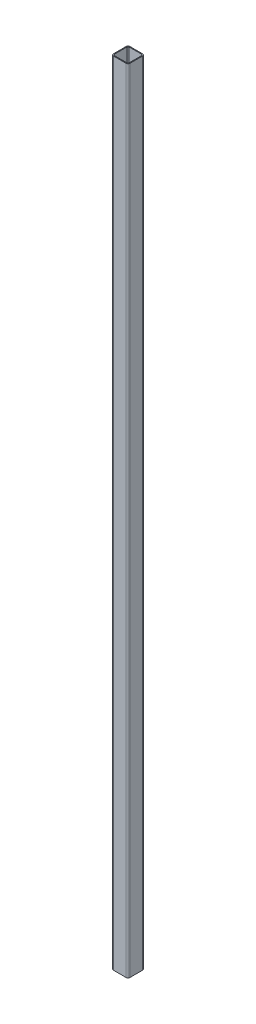
ISO-10303-21;
HEADER;
FILE_DESCRIPTION(('STEP AP214'),'2;1');
FILE_NAME('part.step','',(''),(''),'','','');
FILE_SCHEMA(('AUTOMOTIVE_DESIGN { 1 0 10303 214 1 1 1 1 }'));
ENDSEC;
DATA;
#1=APPLICATION_CONTEXT('core data for automotive mechanical design processes');
#2=APPLICATION_PROTOCOL_DEFINITION('international standard','automotive_design',2000,#1);
#3=PRODUCT_CONTEXT('',#1,'mechanical');
#4=PRODUCT('Part','Part','',(#3));
#5=PRODUCT_RELATED_PRODUCT_CATEGORY('part','',(#4));
#6=PRODUCT_DEFINITION_FORMATION('','',#4);
#7=PRODUCT_DEFINITION_CONTEXT('part definition',#1,'design');
#8=PRODUCT_DEFINITION('design','',#6,#7);
#9=PRODUCT_DEFINITION_SHAPE('','',#8);
#10=(LENGTH_UNIT() NAMED_UNIT(*) SI_UNIT(.MILLI.,.METRE.));
#11=(NAMED_UNIT(*) PLANE_ANGLE_UNIT() SI_UNIT($,.RADIAN.));
#12=(NAMED_UNIT(*) SI_UNIT($,.STERADIAN.) SOLID_ANGLE_UNIT());
#13=UNCERTAINTY_MEASURE_WITH_UNIT(LENGTH_MEASURE(1.E-05),#10,'distance_accuracy_value','');
#14=(GEOMETRIC_REPRESENTATION_CONTEXT(3) GLOBAL_UNCERTAINTY_ASSIGNED_CONTEXT((#13)) GLOBAL_UNIT_ASSIGNED_CONTEXT((#10,
#11,#12)) REPRESENTATION_CONTEXT('',''));
#15=CARTESIAN_POINT('',(0.,0.,0.));
#16=DIRECTION('',(0.,0.,1.));
#17=DIRECTION('',(1.,0.,0.));
#18=AXIS2_PLACEMENT_3D('',#15,#16,#17);
#19=CARTESIAN_POINT('',(-14.9999999999979,6.55031584528842E-12,-885.000000000003));
#20=DIRECTION('',(0.,1.00000000000002,0.));
#21=DIRECTION('',(0.,0.,1.));
#22=AXIS2_PLACEMENT_3D('',#19,#20,#21);
#23=CYLINDRICAL_SURFACE('',#22,3.);
#24=DIRECTION('',(0.,1.00000000000002,0.));
#25=VECTOR('',#24,1.);
#26=CARTESIAN_POINT('',(-15.0000000000001,6.55031584528842E-12,-882.000000000003));
#27=LINE('',#26,#25);
#28=CARTESIAN_POINT('',(-15.0000000000006,20.0000000000066,-882.000000000003));
#29=VERTEX_POINT('',#28);
#30=CARTESIAN_POINT('',(-14.9999999999928,1940.00000000004,-882.000000000015));
#31=VERTEX_POINT('',#30);
#32=EDGE_CURVE('E252',#29,#31,#27,.T.);
#33=ORIENTED_EDGE('',*,*,#32,.F.);
#34=CARTESIAN_POINT('',(-14.9999999999983,20.0000000000066,-885.000000000003));
#35=DIRECTION('',(0.,-1.00000000000002,0.));
#36=DIRECTION('',(0.,0.,-1.));
#37=AXIS2_PLACEMENT_3D('',#34,#35,#36);
#38=CIRCLE('',#37,3.);
#39=CARTESIAN_POINT('',(-17.9999999999982,20.0000000000067,-885.000000000003));
#40=VERTEX_POINT('',#39);
#41=EDGE_CURVE('E276',#29,#40,#38,.T.);
#42=ORIENTED_EDGE('',*,*,#41,.T.);
#43=DIRECTION('',(0.,1.00000000000002,0.));
#44=VECTOR('',#43,1.);
#45=CARTESIAN_POINT('',(-17.999999999998,6.66133814775094E-12,-885.000000000003));
#46=LINE('',#45,#44);
#47=CARTESIAN_POINT('',(-17.9999999999905,1940.00000000004,-885.000000000012));
#48=VERTEX_POINT('',#47);
#49=EDGE_CURVE('E50',#40,#48,#46,.T.);
#50=ORIENTED_EDGE('',*,*,#49,.T.);
#51=CARTESIAN_POINT('',(-14.9999999999908,1940.00000000004,-885.000000000015));
#52=DIRECTION('',(0.,1.00000000000002,0.));
#53=DIRECTION('',(0.,0.,1.));
#54=AXIS2_PLACEMENT_3D('',#51,#52,#53);
#55=CIRCLE('',#54,3.);
#56=EDGE_CURVE('E266',#48,#31,#55,.T.);
#57=ORIENTED_EDGE('',*,*,#56,.T.);
#58=EDGE_LOOP('',(#33,#42,#50,#57));
#59=FACE_BOUND('',#58,.T.);
#60=ADVANCED_FACE('F47',(#59),#23,.F.);
#61=CARTESIAN_POINT('',(-15.0000000000001,6.55031584528842E-12,-882.000000000003));
#62=DIRECTION('',(0.,0.,-1.));
#63=DIRECTION('',(0.,1.00000000000002,0.));
#64=AXIS2_PLACEMENT_3D('',#61,#62,#63);
#65=PLANE('',#64);
#66=DIRECTION('',(0.,1.00000000000002,0.));
#67=VECTOR('',#66,1.);
#68=CARTESIAN_POINT('',(14.9999999999997,3.44169137633799E-12,-882.000000000003));
#69=LINE('',#68,#67);
#70=CARTESIAN_POINT('',(14.9999999999995,20.0000000000066,-882.000000000003));
#71=VERTEX_POINT('',#70);
#72=CARTESIAN_POINT('',(15.000000000007,1940.00000000004,-882.000000000011));
#73=VERTEX_POINT('',#72);
#74=EDGE_CURVE('E248',#71,#73,#69,.T.);
#75=ORIENTED_EDGE('',*,*,#74,.F.);
#76=DIRECTION('',(-0.999999999999991,0.,0.));
#77=VECTOR('',#76,1.);
#78=CARTESIAN_POINT('',(-15.0000000000006,20.0000000000066,-882.000000000003));
#79=LINE('',#78,#77);
#80=EDGE_CURVE('E255',#71,#29,#79,.T.);
#81=ORIENTED_EDGE('',*,*,#80,.T.);
#82=ORIENTED_EDGE('',*,*,#32,.T.);
#83=DIRECTION('',(0.999999999999991,0.,0.));
#84=VECTOR('',#83,1.);
#85=CARTESIAN_POINT('',(-14.9999999999928,1940.00000000004,-882.000000000015));
#86=LINE('',#85,#84);
#87=EDGE_CURVE('E254',#31,#73,#86,.T.);
#88=ORIENTED_EDGE('',*,*,#87,.T.);
#89=EDGE_LOOP('',(#75,#81,#82,#88));
#90=FACE_BOUND('',#89,.T.);
#91=ADVANCED_FACE('F387',(#90),#65,.T.);
#92=CARTESIAN_POINT('',(15.0000000000019,3.44169137633799E-12,-885.000000000003));
#93=DIRECTION('',(0.,1.00000000000002,0.));
#94=DIRECTION('',(0.,0.,1.));
#95=AXIS2_PLACEMENT_3D('',#92,#93,#94);
#96=CYLINDRICAL_SURFACE('',#95,3.);
#97=DIRECTION('',(0.,1.00000000000002,0.));
#98=VECTOR('',#97,1.);
#99=CARTESIAN_POINT('',(18.0000000000018,3.33066907387547E-12,-885.000000000003));
#100=LINE('',#99,#98);
#101=CARTESIAN_POINT('',(17.9999999999993,20.0000000000035,-885.000000000001));
#102=VERTEX_POINT('',#101);
#103=CARTESIAN_POINT('',(18.0000000000093,1940.00000000004,-885.00000000001));
#104=VERTEX_POINT('',#103);
#105=EDGE_CURVE('E243',#102,#104,#100,.T.);
#106=ORIENTED_EDGE('',*,*,#105,.F.);
#107=CARTESIAN_POINT('',(14.9999999999997,20.0000000000066,-885.000000000003));
#108=DIRECTION('',(0.,-1.00000000000002,0.));
#109=DIRECTION('',(0.,0.,-1.));
#110=AXIS2_PLACEMENT_3D('',#107,#108,#109);
#111=CIRCLE('',#110,3.);
#112=EDGE_CURVE('E251',#102,#71,#111,.T.);
#113=ORIENTED_EDGE('',*,*,#112,.T.);
#114=ORIENTED_EDGE('',*,*,#74,.T.);
#115=CARTESIAN_POINT('',(15.0000000000092,1940.00000000004,-885.000000000012));
#116=DIRECTION('',(0.,1.00000000000002,0.));
#117=DIRECTION('',(0.,0.,1.));
#118=AXIS2_PLACEMENT_3D('',#115,#116,#117);
#119=CIRCLE('',#118,3.);
#120=EDGE_CURVE('E250',#73,#104,#119,.T.);
#121=ORIENTED_EDGE('',*,*,#120,.T.);
#122=EDGE_LOOP('',(#106,#113,#114,#121));
#123=FACE_BOUND('',#122,.T.);
#124=ADVANCED_FACE('F380',(#123),#96,.F.);
#125=CARTESIAN_POINT('',(18.0000000000018,3.33066907387547E-12,-885.000000000003));
#126=DIRECTION('',(-0.999999999999991,0.,0.));
#127=DIRECTION('',(0.,0.,1.));
#128=AXIS2_PLACEMENT_3D('',#125,#126,#127);
#129=PLANE('',#128);
#130=DIRECTION('',(0.,1.00000000000002,0.));
#131=VECTOR('',#130,1.);
#132=CARTESIAN_POINT('',(17.9999999999996,3.44169137633799E-12,-915.000000000003));
#133=LINE('',#132,#131);
#134=CARTESIAN_POINT('',(17.9999999999996,20.0000000000035,-915.000000000003));
#135=VERTEX_POINT('',#134);
#136=CARTESIAN_POINT('',(18.0000000000071,1940.00000000004,-915.000000000011));
#137=VERTEX_POINT('',#136);
#138=EDGE_CURVE('E238',#135,#137,#133,.T.);
#139=ORIENTED_EDGE('',*,*,#138,.F.);
#140=DIRECTION('',(0.,0.,1.));
#141=VECTOR('',#140,1.);
#142=CARTESIAN_POINT('',(17.9999999999993,20.0000000000035,-885.000000000003));
#143=LINE('',#142,#141);
#144=EDGE_CURVE('E247',#135,#102,#143,.T.);
#145=ORIENTED_EDGE('',*,*,#144,.T.);
#146=ORIENTED_EDGE('',*,*,#105,.T.);
#147=DIRECTION('',(0.,0.,-1.));
#148=VECTOR('',#147,1.);
#149=CARTESIAN_POINT('',(18.0000000000093,1940.00000000004,-885.000000000012));
#150=LINE('',#149,#148);
#151=EDGE_CURVE('E246',#104,#137,#150,.T.);
#152=ORIENTED_EDGE('',*,*,#151,.T.);
#153=EDGE_LOOP('',(#139,#145,#146,#152));
#154=FACE_BOUND('',#153,.T.);
#155=ADVANCED_FACE('F393',(#154),#129,.T.);
#156=CARTESIAN_POINT('',(14.9999999999997,3.44169137633799E-12,-915.000000000003));
#157=DIRECTION('',(0.,1.00000000000002,0.));
#158=DIRECTION('',(0.,0.,1.));
#159=AXIS2_PLACEMENT_3D('',#156,#157,#158);
#160=CYLINDRICAL_SURFACE('',#159,3.);
#161=DIRECTION('',(0.,1.00000000000002,0.));
#162=VECTOR('',#161,1.);
#163=CARTESIAN_POINT('',(15.0000000000019,3.44169137633799E-12,-918.000000000003));
#164=LINE('',#163,#162);
#165=CARTESIAN_POINT('',(15.0000000000017,20.0000000000067,-918.000000000003));
#166=VERTEX_POINT('',#165);
#167=CARTESIAN_POINT('',(15.0000000000092,1940.00000000004,-918.000000000011));
#168=VERTEX_POINT('',#167);
#169=EDGE_CURVE('E233',#166,#168,#164,.T.);
#170=ORIENTED_EDGE('',*,*,#169,.F.);
#171=CARTESIAN_POINT('',(14.9999999999995,20.0000000000066,-915.000000000003));
#172=DIRECTION('',(0.,-1.00000000000002,0.));
#173=DIRECTION('',(0.,0.,-1.));
#174=AXIS2_PLACEMENT_3D('',#171,#172,#173);
#175=CIRCLE('',#174,3.);
#176=EDGE_CURVE('E242',#166,#135,#175,.T.);
#177=ORIENTED_EDGE('',*,*,#176,.T.);
#178=ORIENTED_EDGE('',*,*,#138,.T.);
#179=CARTESIAN_POINT('',(15.000000000007,1940.00000000004,-915.000000000011));
#180=DIRECTION('',(0.,1.00000000000002,0.));
#181=DIRECTION('',(0.,0.,1.));
#182=AXIS2_PLACEMENT_3D('',#179,#180,#181);
#183=CIRCLE('',#182,3.);
#184=EDGE_CURVE('E241',#137,#168,#183,.T.);
#185=ORIENTED_EDGE('',*,*,#184,.T.);
#186=EDGE_LOOP('',(#170,#177,#178,#185));
#187=FACE_BOUND('',#186,.T.);
#188=ADVANCED_FACE('F400',(#187),#160,.F.);
#189=CARTESIAN_POINT('',(-14.9999999999979,6.66133814775094E-12,-918.000000000003));
#190=DIRECTION('',(0.,0.,1.));
#191=DIRECTION('',(0.,-1.00000000000002,0.));
#192=AXIS2_PLACEMENT_3D('',#189,#190,#191);
#193=PLANE('',#192);
#194=DIRECTION('',(0.,1.00000000000002,0.));
#195=VECTOR('',#194,1.);
#196=CARTESIAN_POINT('',(-14.9999999999979,6.66133814775094E-12,-918.000000000003));
#197=LINE('',#196,#195);
#198=CARTESIAN_POINT('',(-14.9999999999983,20.0000000000066,-918.000000000003));
#199=VERTEX_POINT('',#198);
#200=CARTESIAN_POINT('',(-14.9999999999908,1940.00000000004,-918.000000000015));
#201=VERTEX_POINT('',#200);
#202=EDGE_CURVE('E229',#199,#201,#197,.T.);
#203=ORIENTED_EDGE('',*,*,#202,.F.);
#204=DIRECTION('',(0.999999999999991,0.,0.));
#205=VECTOR('',#204,1.);
#206=CARTESIAN_POINT('',(-14.9999999999983,20.0000000000066,-918.000000000003));
#207=LINE('',#206,#205);
#208=EDGE_CURVE('E237',#199,#166,#207,.T.);
#209=ORIENTED_EDGE('',*,*,#208,.T.);
#210=ORIENTED_EDGE('',*,*,#169,.T.);
#211=DIRECTION('',(-0.999999999999991,0.,0.));
#212=VECTOR('',#211,1.);
#213=CARTESIAN_POINT('',(-14.9999999999908,1940.00000000004,-918.000000000015));
#214=LINE('',#213,#212);
#215=EDGE_CURVE('E236',#168,#201,#214,.T.);
#216=ORIENTED_EDGE('',*,*,#215,.T.);
#217=EDGE_LOOP('',(#203,#209,#210,#216));
#218=FACE_BOUND('',#217,.T.);
#219=ADVANCED_FACE('F404',(#218),#193,.T.);
#220=CARTESIAN_POINT('',(-15.0000000000001,6.66133814775094E-12,-915.000000000003));
#221=DIRECTION('',(0.,1.00000000000002,0.));
#222=DIRECTION('',(0.,0.,1.));
#223=AXIS2_PLACEMENT_3D('',#220,#221,#222);
#224=CYLINDRICAL_SURFACE('',#223,3.);
#225=DIRECTION('',(0.,1.00000000000002,0.));
#226=VECTOR('',#225,1.);
#227=CARTESIAN_POINT('',(-18.0000000000002,6.66133814775094E-12,-915.000000000003));
#228=LINE('',#227,#226);
#229=CARTESIAN_POINT('',(-18.0000000000005,20.0000000000068,-915.000000000003));
#230=VERTEX_POINT('',#229);
#231=CARTESIAN_POINT('',(-17.9999999999927,1940.00000000004,-915.000000000012));
#232=VERTEX_POINT('',#231);
#233=EDGE_CURVE('E205',#230,#232,#228,.T.);
#234=ORIENTED_EDGE('',*,*,#233,.F.);
#235=CARTESIAN_POINT('',(-15.0000000000006,20.0000000000066,-915.000000000003));
#236=DIRECTION('',(0.,-1.00000000000002,0.));
#237=DIRECTION('',(0.,0.,-1.));
#238=AXIS2_PLACEMENT_3D('',#235,#236,#237);
#239=CIRCLE('',#238,3.);
#240=EDGE_CURVE('E232',#230,#199,#239,.T.);
#241=ORIENTED_EDGE('',*,*,#240,.T.);
#242=ORIENTED_EDGE('',*,*,#202,.T.);
#243=CARTESIAN_POINT('',(-14.9999999999928,1940.00000000004,-915.000000000015));
#244=DIRECTION('',(0.,1.00000000000002,0.));
#245=DIRECTION('',(0.,0.,1.));
#246=AXIS2_PLACEMENT_3D('',#243,#244,#245);
#247=CIRCLE('',#246,3.);
#248=EDGE_CURVE('E228',#201,#232,#247,.T.);
#249=ORIENTED_EDGE('',*,*,#248,.T.);
#250=EDGE_LOOP('',(#234,#241,#242,#249));
#251=FACE_BOUND('',#250,.T.);
#252=ADVANCED_FACE('F408',(#251),#224,.F.);
#253=CARTESIAN_POINT('',(-15.4999999999983,6.55031584528842E-12,-884.500000000004));
#254=DIRECTION('',(0.,1.00000000000002,0.));
#255=DIRECTION('',(0.,0.,1.));
#256=AXIS2_PLACEMENT_3D('',#253,#254,#255);
#257=CYLINDRICAL_SURFACE('',#256,4.5);
#258=CARTESIAN_POINT('',(-15.5000000000047,20.0000000000066,-884.500000000004));
#259=DIRECTION('',(0.,-1.00000000000002,0.));
#260=DIRECTION('',(0.,0.,-1.));
#261=AXIS2_PLACEMENT_3D('',#258,#259,#260);
#262=CIRCLE('',#261,4.5);
#263=CARTESIAN_POINT('',(-15.5000000000045,20.0000000000066,-880.000000000003));
#264=VERTEX_POINT('',#263);
#265=CARTESIAN_POINT('',(-20.0000000000047,20.0000000000067,-884.500000000001));
#266=VERTEX_POINT('',#265);
#267=EDGE_CURVE('E57',#264,#266,#262,.T.);
#268=ORIENTED_EDGE('',*,*,#267,.F.);
#269=DIRECTION('',(0.,1.00000000000002,0.));
#270=VECTOR('',#269,1.);
#271=CARTESIAN_POINT('',(-15.4999999999981,6.55031584528842E-12,-880.000000000003));
#272=LINE('',#271,#270);
#273=CARTESIAN_POINT('',(-15.4999999999907,1940.00000000004,-880.000000000012));
#274=VERTEX_POINT('',#273);
#275=EDGE_CURVE('E189',#264,#274,#272,.T.);
#276=ORIENTED_EDGE('',*,*,#275,.T.);
#277=CARTESIAN_POINT('',(-15.499999999997,1940.00000000004,-884.500000000011));
#278=DIRECTION('',(0.,1.00000000000002,0.));
#279=DIRECTION('',(0.,0.,1.));
#280=AXIS2_PLACEMENT_3D('',#277,#278,#279);
#281=CIRCLE('',#280,4.5);
#282=CARTESIAN_POINT('',(-19.9999999999971,1940.00000000004,-884.50000000001));
#283=VERTEX_POINT('',#282);
#284=EDGE_CURVE('E321',#283,#274,#281,.T.);
#285=ORIENTED_EDGE('',*,*,#284,.F.);
#286=DIRECTION('',(0.,1.00000000000002,0.));
#287=VECTOR('',#286,1.);
#288=CARTESIAN_POINT('',(-19.9999999999982,6.66133814775094E-12,-884.500000000003));
#289=LINE('',#288,#287);
#290=EDGE_CURVE('E223',#266,#283,#289,.T.);
#291=ORIENTED_EDGE('',*,*,#290,.F.);
#292=EDGE_LOOP('',(#268,#276,#285,#291));
#293=FACE_BOUND('',#292,.T.);
#294=ADVANCED_FACE('F350',(#293),#257,.T.);
#295=CARTESIAN_POINT('',(-19.9999999999982,6.66133814775094E-12,-884.500000000003));
#296=DIRECTION('',(0.999999999999991,0.,0.));
#297=DIRECTION('',(0.,0.,-1.));
#298=AXIS2_PLACEMENT_3D('',#295,#296,#297);
#299=PLANE('',#298);
#300=DIRECTION('',(0.,0.,-1.));
#301=VECTOR('',#300,1.);
#302=CARTESIAN_POINT('',(-20.0000000000065,20.0000000000022,-2.22044604925031E-12));
#303=LINE('',#302,#301);
#304=CARTESIAN_POINT('',(-20.0000000000025,20.0000000000068,-915.500000000002));
#305=VERTEX_POINT('',#304);
#306=EDGE_CURVE('E11',#266,#305,#303,.T.);
#307=ORIENTED_EDGE('',*,*,#306,.F.);
#308=ORIENTED_EDGE('',*,*,#290,.T.);
#309=DIRECTION('',(0.,0.,1.));
#310=VECTOR('',#309,1.);
#311=CARTESIAN_POINT('',(-19.9999999999891,1940.00000000005,-3060.));
#312=LINE('',#311,#310);
#313=CARTESIAN_POINT('',(-19.9999999999949,1940.00000000004,-915.500000000012));
#314=VERTEX_POINT('',#313);
#315=EDGE_CURVE('E327',#314,#283,#312,.T.);
#316=ORIENTED_EDGE('',*,*,#315,.F.);
#317=DIRECTION('',(0.,1.00000000000002,0.));
#318=VECTOR('',#317,1.);
#319=CARTESIAN_POINT('',(-19.999999999996,6.66133814775094E-12,-915.500000000002));
#320=LINE('',#319,#318);
#321=EDGE_CURVE('E220',#305,#314,#320,.T.);
#322=ORIENTED_EDGE('',*,*,#321,.F.);
#323=EDGE_LOOP('',(#307,#308,#316,#322));
#324=FACE_BOUND('',#323,.T.);
#325=ADVANCED_FACE('F346',(#324),#299,.F.);
#326=CARTESIAN_POINT('',(-15.4999999999961,6.66133814775094E-12,-915.500000000004));
#327=DIRECTION('',(0.,1.00000000000002,0.));
#328=DIRECTION('',(0.,0.,1.));
#329=AXIS2_PLACEMENT_3D('',#326,#327,#328);
#330=CYLINDRICAL_SURFACE('',#329,4.5);
#331=CARTESIAN_POINT('',(-15.5000000000027,20.0000000000066,-915.500000000004));
#332=DIRECTION('',(0.,-1.00000000000002,0.));
#333=DIRECTION('',(0.,0.,-1.));
#334=AXIS2_PLACEMENT_3D('',#331,#332,#333);
#335=CIRCLE('',#334,4.5);
#336=CARTESIAN_POINT('',(-15.5000000000027,20.0000000000066,-920.000000000004));
#337=VERTEX_POINT('',#336);
#338=EDGE_CURVE('E316',#305,#337,#335,.T.);
#339=ORIENTED_EDGE('',*,*,#338,.F.);
#340=ORIENTED_EDGE('',*,*,#321,.T.);
#341=CARTESIAN_POINT('',(-15.499999999995,1940.00000000004,-915.500000000012));
#342=DIRECTION('',(0.,1.00000000000002,0.));
#343=DIRECTION('',(0.,0.,1.));
#344=AXIS2_PLACEMENT_3D('',#341,#342,#343);
#345=CIRCLE('',#344,4.5);
#346=CARTESIAN_POINT('',(-15.499999999995,1940.00000000004,-920.000000000012));
#347=VERTEX_POINT('',#346);
#348=EDGE_CURVE('E323',#347,#314,#345,.T.);
#349=ORIENTED_EDGE('',*,*,#348,.F.);
#350=DIRECTION('',(0.,1.00000000000002,0.));
#351=VECTOR('',#350,1.);
#352=CARTESIAN_POINT('',(-15.4999999999961,6.66133814775094E-12,-920.000000000004));
#353=LINE('',#352,#351);
#354=EDGE_CURVE('E217',#337,#347,#353,.T.);
#355=ORIENTED_EDGE('',*,*,#354,.F.);
#356=EDGE_LOOP('',(#339,#340,#349,#355));
#357=FACE_BOUND('',#356,.T.);
#358=ADVANCED_FACE('F421',(#357),#330,.T.);
#359=CARTESIAN_POINT('',(-15.4999999999961,6.66133814775094E-12,-920.000000000004));
#360=DIRECTION('',(0.,0.,1.));
#361=DIRECTION('',(0.,-1.00000000000002,0.));
#362=AXIS2_PLACEMENT_3D('',#359,#360,#361);
#363=PLANE('',#362);
#364=DIRECTION('',(0.999999999999991,0.,0.));
#365=VECTOR('',#364,1.);
#366=CARTESIAN_POINT('',(-15.5000000000027,20.0000000000066,-920.000000000004));
#367=LINE('',#366,#365);
#368=CARTESIAN_POINT('',(15.4999999999974,20.0000000000058,-920.000000000003));
#369=VERTEX_POINT('',#368);
#370=EDGE_CURVE('E334',#337,#369,#367,.T.);
#371=ORIENTED_EDGE('',*,*,#370,.F.);
#372=ORIENTED_EDGE('',*,*,#354,.T.);
#373=DIRECTION('',(-0.999999999999991,0.,0.));
#374=VECTOR('',#373,1.);
#375=CARTESIAN_POINT('',(-15.499999999995,1940.00000000004,-920.000000000012));
#376=LINE('',#375,#374);
#377=CARTESIAN_POINT('',(15.500000000005,1940.00000000004,-920.000000000015));
#378=VERTEX_POINT('',#377);
#379=EDGE_CURVE('E311',#378,#347,#376,.T.);
#380=ORIENTED_EDGE('',*,*,#379,.F.);
#381=DIRECTION('',(0.,1.00000000000002,0.));
#382=VECTOR('',#381,1.);
#383=CARTESIAN_POINT('',(15.5000000000038,3.44169137633799E-12,-920.000000000003));
#384=LINE('',#383,#382);
#385=EDGE_CURVE('E214',#369,#378,#384,.T.);
#386=ORIENTED_EDGE('',*,*,#385,.F.);
#387=EDGE_LOOP('',(#371,#372,#380,#386));
#388=FACE_BOUND('',#387,.T.);
#389=ADVANCED_FACE('F424',(#388),#363,.F.);
#390=CARTESIAN_POINT('',(15.5000000000038,3.44169137633799E-12,-915.500000000002));
#391=DIRECTION('',(0.,1.00000000000002,0.));
#392=DIRECTION('',(0.,0.,1.));
#393=AXIS2_PLACEMENT_3D('',#390,#391,#392);
#394=CYLINDRICAL_SURFACE('',#393,4.5);
#395=CARTESIAN_POINT('',(15.4999999999974,20.0000000000056,-915.500000000002));
#396=DIRECTION('',(0.,-1.00000000000002,0.));
#397=DIRECTION('',(0.,0.,-1.));
#398=AXIS2_PLACEMENT_3D('',#395,#396,#397);
#399=CIRCLE('',#398,4.5);
#400=CARTESIAN_POINT('',(19.9999999999974,20.0000000000035,-915.5));
#401=VERTEX_POINT('',#400);
#402=EDGE_CURVE('E181',#369,#401,#399,.T.);
#403=ORIENTED_EDGE('',*,*,#402,.F.);
#404=ORIENTED_EDGE('',*,*,#385,.T.);
#405=CARTESIAN_POINT('',(15.500000000005,1940.00000000004,-915.500000000015));
#406=DIRECTION('',(0.,1.00000000000002,0.));
#407=DIRECTION('',(0.,0.,1.));
#408=AXIS2_PLACEMENT_3D('',#405,#406,#407);
#409=CIRCLE('',#408,4.5);
#410=CARTESIAN_POINT('',(20.0000000000049,1940.00000000004,-915.500000000012));
#411=VERTEX_POINT('',#410);
#412=EDGE_CURVE('E306',#411,#378,#409,.T.);
#413=ORIENTED_EDGE('',*,*,#412,.F.);
#414=DIRECTION('',(0.,1.00000000000002,0.));
#415=VECTOR('',#414,1.);
#416=CARTESIAN_POINT('',(20.000000000004,3.44169137633799E-12,-915.499999999999));
#417=LINE('',#416,#415);
#418=EDGE_CURVE('E211',#401,#411,#417,.T.);
#419=ORIENTED_EDGE('',*,*,#418,.F.);
#420=EDGE_LOOP('',(#403,#404,#413,#419));
#421=FACE_BOUND('',#420,.T.);
#422=ADVANCED_FACE('F303',(#421),#394,.T.);
#423=CARTESIAN_POINT('',(20.0000000000018,3.33066907387547E-12,-884.499999999999));
#424=DIRECTION('',(-0.999999999999991,0.,0.));
#425=DIRECTION('',(0.,0.,1.));
#426=AXIS2_PLACEMENT_3D('',#423,#424,#425);
#427=PLANE('',#426);
#428=DIRECTION('',(0.,0.,-1.));
#429=VECTOR('',#428,1.);
#430=CARTESIAN_POINT('',(19.9999999999934,19.999999999999,-3.33066907387547E-13));
#431=LINE('',#430,#429);
#432=CARTESIAN_POINT('',(19.9999999999951,20.0000000000035,-884.499999999999));
#433=VERTEX_POINT('',#432);
#434=EDGE_CURVE('E176',#433,#401,#431,.T.);
#435=ORIENTED_EDGE('',*,*,#434,.T.);
#436=ORIENTED_EDGE('',*,*,#418,.T.);
#437=DIRECTION('',(0.,0.,1.));
#438=VECTOR('',#437,1.);
#439=CARTESIAN_POINT('',(20.0000000000107,1940.00000000005,-3060.));
#440=LINE('',#439,#438);
#441=CARTESIAN_POINT('',(20.0000000000029,1940.00000000004,-884.500000000012));
#442=VERTEX_POINT('',#441);
#443=EDGE_CURVE('E207',#411,#442,#440,.T.);
#444=ORIENTED_EDGE('',*,*,#443,.T.);
#445=DIRECTION('',(0.,1.00000000000002,0.));
#446=VECTOR('',#445,1.);
#447=CARTESIAN_POINT('',(20.0000000000018,3.33066907387547E-12,-884.499999999999));
#448=LINE('',#447,#446);
#449=EDGE_CURVE('E198',#433,#442,#448,.T.);
#450=ORIENTED_EDGE('',*,*,#449,.F.);
#451=EDGE_LOOP('',(#435,#436,#444,#450));
#452=FACE_BOUND('',#451,.T.);
#453=ADVANCED_FACE('F297',(#452),#427,.F.);
#454=CARTESIAN_POINT('',(15.5000000000018,3.44169137633799E-12,-884.500000000003));
#455=DIRECTION('',(0.,1.00000000000002,0.));
#456=DIRECTION('',(0.,0.,1.));
#457=AXIS2_PLACEMENT_3D('',#454,#455,#456);
#458=CYLINDRICAL_SURFACE('',#457,4.5);
#459=CARTESIAN_POINT('',(15.4999999999952,20.0000000000056,-884.500000000003));
#460=DIRECTION('',(0.,-1.00000000000002,0.));
#461=DIRECTION('',(0.,0.,-1.));
#462=AXIS2_PLACEMENT_3D('',#459,#460,#461);
#463=CIRCLE('',#462,4.5);
#464=CARTESIAN_POINT('',(15.4999999999952,20.0000000000056,-880.000000000003));
#465=VERTEX_POINT('',#464);
#466=EDGE_CURVE('E170',#433,#465,#463,.T.);
#467=ORIENTED_EDGE('',*,*,#466,.F.);
#468=ORIENTED_EDGE('',*,*,#449,.T.);
#469=CARTESIAN_POINT('',(15.500000000003,1940.00000000004,-884.500000000015));
#470=DIRECTION('',(0.,1.00000000000002,0.));
#471=DIRECTION('',(0.,0.,1.));
#472=AXIS2_PLACEMENT_3D('',#469,#470,#471);
#473=CIRCLE('',#472,4.5);
#474=CARTESIAN_POINT('',(15.500000000005,1940.00000000004,-880.000000000016));
#475=VERTEX_POINT('',#474);
#476=EDGE_CURVE('E195',#475,#442,#473,.T.);
#477=ORIENTED_EDGE('',*,*,#476,.F.);
#478=DIRECTION('',(0.,1.00000000000002,0.));
#479=VECTOR('',#478,1.);
#480=CARTESIAN_POINT('',(15.5000000000018,3.44169137633799E-12,-880.000000000003));
#481=LINE('',#480,#479);
#482=EDGE_CURVE('E187',#465,#475,#481,.T.);
#483=ORIENTED_EDGE('',*,*,#482,.F.);
#484=EDGE_LOOP('',(#467,#468,#477,#483));
#485=FACE_BOUND('',#484,.T.);
#486=ADVANCED_FACE('F193',(#485),#458,.T.);
#487=CARTESIAN_POINT('',(-15.4999999999981,6.55031584528842E-12,-880.000000000003));
#488=DIRECTION('',(0.,0.,-1.));
#489=DIRECTION('',(0.,1.00000000000002,0.));
#490=AXIS2_PLACEMENT_3D('',#487,#488,#489);
#491=PLANE('',#490);
#492=DIRECTION('',(-0.999999999999991,0.,0.));
#493=VECTOR('',#492,1.);
#494=CARTESIAN_POINT('',(-15.5000000000045,20.0000000000066,-880.000000000003));
#495=LINE('',#494,#493);
#496=EDGE_CURVE('E173',#465,#264,#495,.T.);
#497=ORIENTED_EDGE('',*,*,#496,.F.);
#498=ORIENTED_EDGE('',*,*,#482,.T.);
#499=DIRECTION('',(0.999999999999991,0.,0.));
#500=VECTOR('',#499,1.);
#501=CARTESIAN_POINT('',(-15.4999999999907,1940.00000000004,-880.000000000012));
#502=LINE('',#501,#500);
#503=EDGE_CURVE('E318',#274,#475,#502,.T.);
#504=ORIENTED_EDGE('',*,*,#503,.F.);
#505=ORIENTED_EDGE('',*,*,#275,.F.);
#506=EDGE_LOOP('',(#497,#498,#504,#505));
#507=FACE_BOUND('',#506,.T.);
#508=ADVANCED_FACE('F185',(#507),#491,.F.);
#509=CARTESIAN_POINT('',(-17.999999999998,6.66133814775094E-12,-885.000000000003));
#510=DIRECTION('',(0.999999999999991,0.,0.));
#511=DIRECTION('',(0.,0.,-1.));
#512=AXIS2_PLACEMENT_3D('',#509,#510,#511);
#513=PLANE('',#512);
#514=ORIENTED_EDGE('',*,*,#49,.F.);
#515=DIRECTION('',(0.,0.,-1.));
#516=VECTOR('',#515,1.);
#517=CARTESIAN_POINT('',(-17.9999999999982,20.0000000000067,-885.000000000003));
#518=LINE('',#517,#516);
#519=EDGE_CURVE('E197',#40,#230,#518,.T.);
#520=ORIENTED_EDGE('',*,*,#519,.T.);
#521=ORIENTED_EDGE('',*,*,#233,.T.);
#522=DIRECTION('',(0.,0.,1.));
#523=VECTOR('',#522,1.);
#524=CARTESIAN_POINT('',(-17.9999999999905,1940.00000000004,-885.000000000012));
#525=LINE('',#524,#523);
#526=EDGE_CURVE('E328',#232,#48,#525,.T.);
#527=ORIENTED_EDGE('',*,*,#526,.T.);
#528=EDGE_LOOP('',(#514,#520,#521,#527));
#529=FACE_BOUND('',#528,.T.);
#530=ADVANCED_FACE('F413',(#529),#513,.T.);
#531=CARTESIAN_POINT('',(-15.4999999999894,1940.00000000005,-3060.00000000002));
#532=DIRECTION('',(0.,1.00000000000002,0.));
#533=DIRECTION('',(0.,0.,1.));
#534=AXIS2_PLACEMENT_3D('',#531,#532,#533);
#535=PLANE('',#534);
#536=ORIENTED_EDGE('',*,*,#526,.F.);
#537=ORIENTED_EDGE('',*,*,#248,.F.);
#538=ORIENTED_EDGE('',*,*,#215,.F.);
#539=ORIENTED_EDGE('',*,*,#184,.F.);
#540=ORIENTED_EDGE('',*,*,#151,.F.);
#541=ORIENTED_EDGE('',*,*,#120,.F.);
#542=ORIENTED_EDGE('',*,*,#87,.F.);
#543=ORIENTED_EDGE('',*,*,#56,.F.);
#544=EDGE_LOOP('',(#536,#537,#538,#539,#540,#541,#542,#543));
#545=FACE_BOUND('',#544,.T.);
#546=ORIENTED_EDGE('',*,*,#348,.T.);
#547=ORIENTED_EDGE('',*,*,#315,.T.);
#548=ORIENTED_EDGE('',*,*,#284,.T.);
#549=ORIENTED_EDGE('',*,*,#503,.T.);
#550=ORIENTED_EDGE('',*,*,#476,.T.);
#551=ORIENTED_EDGE('',*,*,#443,.F.);
#552=ORIENTED_EDGE('',*,*,#412,.T.);
#553=ORIENTED_EDGE('',*,*,#379,.T.);
#554=EDGE_LOOP('',(#546,#547,#548,#549,#550,#551,#552,#553));
#555=FACE_BOUND('',#554,.T.);
#556=ADVANCED_FACE('F384',(#545,#555),#535,.T.);
#557=CARTESIAN_POINT('',(-15.5000000000063,20.0000000000021,0.));
#558=DIRECTION('',(0.,-1.00000000000002,0.));
#559=DIRECTION('',(0.,0.,-1.));
#560=AXIS2_PLACEMENT_3D('',#557,#558,#559);
#561=PLANE('',#560);
#562=ORIENTED_EDGE('',*,*,#80,.F.);
#563=ORIENTED_EDGE('',*,*,#112,.F.);
#564=ORIENTED_EDGE('',*,*,#144,.F.);
#565=ORIENTED_EDGE('',*,*,#176,.F.);
#566=ORIENTED_EDGE('',*,*,#208,.F.);
#567=ORIENTED_EDGE('',*,*,#240,.F.);
#568=ORIENTED_EDGE('',*,*,#519,.F.);
#569=ORIENTED_EDGE('',*,*,#41,.F.);
#570=EDGE_LOOP('',(#562,#563,#564,#565,#566,#567,#568,#569));
#571=FACE_BOUND('',#570,.T.);
#572=ORIENTED_EDGE('',*,*,#338,.T.);
#573=ORIENTED_EDGE('',*,*,#370,.T.);
#574=ORIENTED_EDGE('',*,*,#402,.T.);
#575=ORIENTED_EDGE('',*,*,#434,.F.);
#576=ORIENTED_EDGE('',*,*,#466,.T.);
#577=ORIENTED_EDGE('',*,*,#496,.T.);
#578=ORIENTED_EDGE('',*,*,#267,.T.);
#579=ORIENTED_EDGE('',*,*,#306,.T.);
#580=EDGE_LOOP('',(#572,#573,#574,#575,#576,#577,#578,#579));
#581=FACE_BOUND('',#580,.T.);
#582=ADVANCED_FACE('F172',(#571,#581),#561,.T.);
#583=CLOSED_SHELL('',(#60,#91,#124,#155,#188,#219,#252,#294,#325,#358,#389,#422,#453,#486,#508,
#530,#556,#582));
#584=MANIFOLD_SOLID_BREP('B2',#583);
#585=ADVANCED_BREP_SHAPE_REPRESENTATION('',(#18,#584),#14);
#586=SHAPE_DEFINITION_REPRESENTATION(#9,#585);
ENDSEC;
END-ISO-10303-21;
